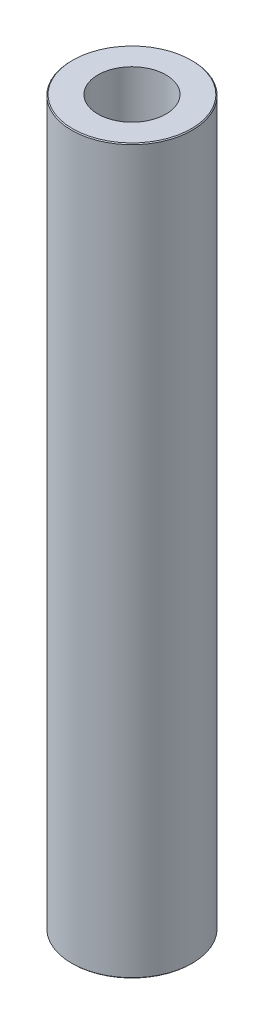
ISO-10303-21;
HEADER;
FILE_DESCRIPTION(('STEP AP214'),'2;1');
FILE_NAME('part.step','',(''),(''),'','','');
FILE_SCHEMA(('AUTOMOTIVE_DESIGN { 1 0 10303 214 1 1 1 1 }'));
ENDSEC;
DATA;
#1=APPLICATION_CONTEXT('core data for automotive mechanical design processes');
#2=APPLICATION_PROTOCOL_DEFINITION('international standard','automotive_design',2000,#1);
#3=PRODUCT_CONTEXT('',#1,'mechanical');
#4=PRODUCT('Part','Part','',(#3));
#5=PRODUCT_RELATED_PRODUCT_CATEGORY('part','',(#4));
#6=PRODUCT_DEFINITION_FORMATION('','',#4);
#7=PRODUCT_DEFINITION_CONTEXT('part definition',#1,'design');
#8=PRODUCT_DEFINITION('design','',#6,#7);
#9=PRODUCT_DEFINITION_SHAPE('','',#8);
#10=(LENGTH_UNIT() NAMED_UNIT(*) SI_UNIT(.MILLI.,.METRE.));
#11=(NAMED_UNIT(*) PLANE_ANGLE_UNIT() SI_UNIT($,.RADIAN.));
#12=(NAMED_UNIT(*) SI_UNIT($,.STERADIAN.) SOLID_ANGLE_UNIT());
#13=UNCERTAINTY_MEASURE_WITH_UNIT(LENGTH_MEASURE(1.E-05),#10,'distance_accuracy_value','');
#14=(GEOMETRIC_REPRESENTATION_CONTEXT(3) GLOBAL_UNCERTAINTY_ASSIGNED_CONTEXT((#13)) GLOBAL_UNIT_ASSIGNED_CONTEXT((#10,
#11,#12)) REPRESENTATION_CONTEXT('',''));
#15=CARTESIAN_POINT('',(0.,0.,0.));
#16=DIRECTION('',(0.,0.,1.));
#17=DIRECTION('',(1.,0.,0.));
#18=AXIS2_PLACEMENT_3D('',#15,#16,#17);
#19=CARTESIAN_POINT('',(0.,600.,0.));
#20=DIRECTION('',(0.,-1.,0.));
#21=DIRECTION('',(0.,0.,-1.));
#22=AXIS2_PLACEMENT_3D('',#19,#20,#21);
#23=CYLINDRICAL_SURFACE('',#22,50.);
#24=CARTESIAN_POINT('',(0.,599.251591218954,0.));
#25=DIRECTION('',(0.,1.,0.));
#26=DIRECTION('',(0.,0.,1.));
#27=AXIS2_PLACEMENT_3D('',#24,#25,#26);
#28=CIRCLE('',#27,50.);
#29=CARTESIAN_POINT('',(0.,599.251591218954,50.));
#30=VERTEX_POINT('',#29);
#31=EDGE_CURVE('E50',#30,#30,#28,.F.);
#32=ORIENTED_EDGE('',*,*,#31,.T.);
#33=EDGE_LOOP('',(#32));
#34=FACE_BOUND('',#33,.T.);
#35=CARTESIAN_POINT('',(0.,0.748408781045651,0.));
#36=DIRECTION('',(0.,1.,0.));
#37=DIRECTION('',(0.,0.,1.));
#38=AXIS2_PLACEMENT_3D('',#35,#36,#37);
#39=CIRCLE('',#38,50.);
#40=CARTESIAN_POINT('',(0.,0.748408781045651,50.));
#41=VERTEX_POINT('',#40);
#42=EDGE_CURVE('E51',#41,#41,#39,.T.);
#43=ORIENTED_EDGE('',*,*,#42,.T.);
#44=EDGE_LOOP('',(#43));
#45=FACE_BOUND('',#44,.T.);
#46=ADVANCED_FACE('F39',(#34,#45),#23,.T.);
#47=CARTESIAN_POINT('',(0.,600.,0.));
#48=DIRECTION('',(0.,1.,0.));
#49=DIRECTION('',(0.,0.,1.));
#50=AXIS2_PLACEMENT_3D('',#47,#48,#49);
#51=PLANE('',#50);
#52=CARTESIAN_POINT('',(0.,600.,0.));
#53=DIRECTION('',(0.,1.,0.));
#54=DIRECTION('',(0.,0.,1.));
#55=AXIS2_PLACEMENT_3D('',#52,#53,#54);
#56=CIRCLE('',#55,49.2515912189543);
#57=CARTESIAN_POINT('',(0.,600.,49.2515912189543));
#58=VERTEX_POINT('',#57);
#59=EDGE_CURVE('E54',#58,#58,#56,.T.);
#60=ORIENTED_EDGE('',*,*,#59,.T.);
#61=EDGE_LOOP('',(#60));
#62=FACE_BOUND('',#61,.T.);
#63=CARTESIAN_POINT('',(0.,600.,0.));
#64=DIRECTION('',(0.,1.,0.));
#65=DIRECTION('',(0.,0.,1.));
#66=AXIS2_PLACEMENT_3D('',#63,#64,#65);
#67=CIRCLE('',#66,28.2095529428368);
#68=CARTESIAN_POINT('',(0.,600.,28.2095529428368));
#69=VERTEX_POINT('',#68);
#70=EDGE_CURVE('E58',#69,#69,#67,.T.);
#71=ORIENTED_EDGE('',*,*,#70,.F.);
#72=EDGE_LOOP('',(#71));
#73=FACE_BOUND('',#72,.T.);
#74=ADVANCED_FACE('F69',(#62,#73),#51,.T.);
#75=CARTESIAN_POINT('',(0.,0.,0.));
#76=DIRECTION('',(0.,1.,0.));
#77=DIRECTION('',(0.,0.,1.));
#78=AXIS2_PLACEMENT_3D('',#75,#76,#77);
#79=PLANE('',#78);
#80=CARTESIAN_POINT('',(0.,0.,0.));
#81=DIRECTION('',(0.,1.,0.));
#82=DIRECTION('',(0.,0.,1.));
#83=AXIS2_PLACEMENT_3D('',#80,#81,#82);
#84=CIRCLE('',#83,49.2515912189543);
#85=CARTESIAN_POINT('',(0.,0.,49.2515912189543));
#86=VERTEX_POINT('',#85);
#87=EDGE_CURVE('E10',#86,#86,#84,.F.);
#88=ORIENTED_EDGE('',*,*,#87,.T.);
#89=EDGE_LOOP('',(#88));
#90=FACE_BOUND('',#89,.T.);
#91=CARTESIAN_POINT('',(0.,0.,0.));
#92=DIRECTION('',(0.,1.,0.));
#93=DIRECTION('',(0.,0.,1.));
#94=AXIS2_PLACEMENT_3D('',#91,#92,#93);
#95=CIRCLE('',#94,28.2095529428368);
#96=CARTESIAN_POINT('',(0.,0.,28.2095529428368));
#97=VERTEX_POINT('',#96);
#98=EDGE_CURVE('E63',#97,#97,#95,.T.);
#99=ORIENTED_EDGE('',*,*,#98,.T.);
#100=EDGE_LOOP('',(#99));
#101=FACE_BOUND('',#100,.T.);
#102=ADVANCED_FACE('F75',(#90,#101),#79,.F.);
#103=CARTESIAN_POINT('',(0.,600.,0.));
#104=DIRECTION('',(0.,-1.,0.));
#105=DIRECTION('',(0.,0.,-1.));
#106=AXIS2_PLACEMENT_3D('',#103,#104,#105);
#107=CYLINDRICAL_SURFACE('',#106,28.2095529428368);
#108=ORIENTED_EDGE('',*,*,#70,.T.);
#109=EDGE_LOOP('',(#108));
#110=FACE_BOUND('',#109,.T.);
#111=ORIENTED_EDGE('',*,*,#98,.F.);
#112=EDGE_LOOP('',(#111));
#113=FACE_BOUND('',#112,.T.);
#114=ADVANCED_FACE('F70',(#110,#113),#107,.F.);
#115=CARTESIAN_POINT('',(0.,600.,0.));
#116=DIRECTION('',(0.,-1.,0.));
#117=DIRECTION('',(0.,0.,-1.));
#118=AXIS2_PLACEMENT_3D('',#115,#116,#117);
#119=CONICAL_SURFACE('',#118,49.2515912189543,0.785398163397346);
#120=ORIENTED_EDGE('',*,*,#31,.F.);
#121=EDGE_LOOP('',(#120));
#122=FACE_BOUND('',#121,.T.);
#123=ORIENTED_EDGE('',*,*,#59,.F.);
#124=EDGE_LOOP('',(#123));
#125=FACE_BOUND('',#124,.T.);
#126=ADVANCED_FACE('F81',(#122,#125),#119,.T.);
#127=CARTESIAN_POINT('',(0.,0.748408781045651,0.));
#128=DIRECTION('',(0.,1.,0.));
#129=DIRECTION('',(0.,0.,1.));
#130=AXIS2_PLACEMENT_3D('',#127,#128,#129);
#131=CONICAL_SURFACE('',#130,50.,0.78539816339749);
#132=ORIENTED_EDGE('',*,*,#87,.F.);
#133=EDGE_LOOP('',(#132));
#134=FACE_BOUND('',#133,.T.);
#135=ORIENTED_EDGE('',*,*,#42,.F.);
#136=EDGE_LOOP('',(#135));
#137=FACE_BOUND('',#136,.T.);
#138=ADVANCED_FACE('F45',(#134,#137),#131,.T.);
#139=CLOSED_SHELL('',(#46,#74,#102,#114,#126,#138));
#140=MANIFOLD_SOLID_BREP('B2',#139);
#141=ADVANCED_BREP_SHAPE_REPRESENTATION('',(#18,#140),#14);
#142=SHAPE_DEFINITION_REPRESENTATION(#9,#141);
ENDSEC;
END-ISO-10303-21;
